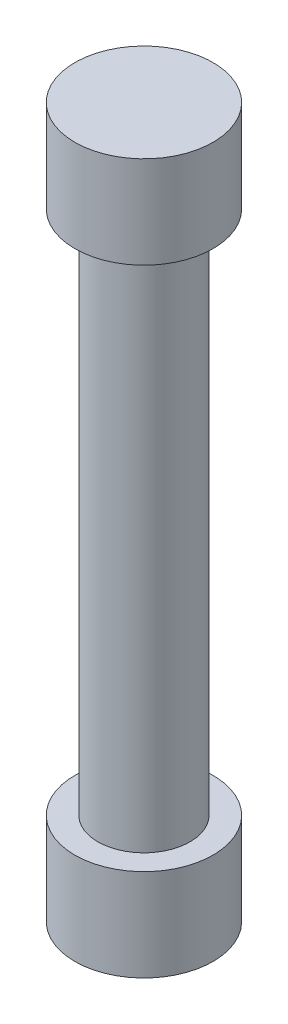
ISO-10303-21;
HEADER;
FILE_DESCRIPTION(('STEP AP214'),'2;1');
FILE_NAME('part.step','',(''),(''),'','','');
FILE_SCHEMA(('AUTOMOTIVE_DESIGN { 1 0 10303 214 1 1 1 1 }'));
ENDSEC;
DATA;
#1=APPLICATION_CONTEXT('core data for automotive mechanical design processes');
#2=APPLICATION_PROTOCOL_DEFINITION('international standard','automotive_design',2000,#1);
#3=PRODUCT_CONTEXT('',#1,'mechanical');
#4=PRODUCT('Part','Part','',(#3));
#5=PRODUCT_RELATED_PRODUCT_CATEGORY('part','',(#4));
#6=PRODUCT_DEFINITION_FORMATION('','',#4);
#7=PRODUCT_DEFINITION_CONTEXT('part definition',#1,'design');
#8=PRODUCT_DEFINITION('design','',#6,#7);
#9=PRODUCT_DEFINITION_SHAPE('','',#8);
#10=(LENGTH_UNIT() NAMED_UNIT(*) SI_UNIT(.MILLI.,.METRE.));
#11=(NAMED_UNIT(*) PLANE_ANGLE_UNIT() SI_UNIT($,.RADIAN.));
#12=(NAMED_UNIT(*) SI_UNIT($,.STERADIAN.) SOLID_ANGLE_UNIT());
#13=UNCERTAINTY_MEASURE_WITH_UNIT(LENGTH_MEASURE(1.E-05),#10,'distance_accuracy_value','');
#14=(GEOMETRIC_REPRESENTATION_CONTEXT(3) GLOBAL_UNCERTAINTY_ASSIGNED_CONTEXT((#13)) GLOBAL_UNIT_ASSIGNED_CONTEXT((#10,
#11,#12)) REPRESENTATION_CONTEXT('',''));
#15=CARTESIAN_POINT('',(0.,0.,0.));
#16=DIRECTION('',(0.,0.,1.));
#17=DIRECTION('',(1.,0.,0.));
#18=AXIS2_PLACEMENT_3D('',#15,#16,#17);
#19=CARTESIAN_POINT('',(0.,17.1,0.));
#20=DIRECTION('',(0.,-1.,0.));
#21=DIRECTION('',(0.,0.,-1.));
#22=AXIS2_PLACEMENT_3D('',#19,#20,#21);
#23=CYLINDRICAL_SURFACE('',#22,1.5);
#24=CARTESIAN_POINT('',(0.,17.1,0.));
#25=DIRECTION('',(0.,1.,0.));
#26=DIRECTION('',(0.,0.,1.));
#27=AXIS2_PLACEMENT_3D('',#24,#25,#26);
#28=CIRCLE('',#27,1.5);
#29=CARTESIAN_POINT('',(0.,17.1,1.5));
#30=VERTEX_POINT('',#29);
#31=EDGE_CURVE('E10',#30,#30,#28,.T.);
#32=ORIENTED_EDGE('',*,*,#31,.F.);
#33=EDGE_LOOP('',(#32));
#34=FACE_BOUND('',#33,.T.);
#35=CARTESIAN_POINT('',(0.,0.,0.));
#36=DIRECTION('',(0.,1.,0.));
#37=DIRECTION('',(0.,0.,1.));
#38=AXIS2_PLACEMENT_3D('',#35,#36,#37);
#39=CIRCLE('',#38,1.5);
#40=CARTESIAN_POINT('',(0.,0.,1.5));
#41=VERTEX_POINT('',#40);
#42=EDGE_CURVE('E37',#41,#41,#39,.T.);
#43=ORIENTED_EDGE('',*,*,#42,.T.);
#44=EDGE_LOOP('',(#43));
#45=FACE_BOUND('',#44,.T.);
#46=ADVANCED_FACE('F34',(#34,#45),#23,.T.);
#47=CARTESIAN_POINT('',(0.,20.1,0.));
#48=DIRECTION('',(0.,-1.,0.));
#49=DIRECTION('',(0.,0.,-1.));
#50=AXIS2_PLACEMENT_3D('',#47,#48,#49);
#51=CYLINDRICAL_SURFACE('',#50,2.25);
#52=CARTESIAN_POINT('',(0.,20.1,0.));
#53=DIRECTION('',(0.,1.,0.));
#54=DIRECTION('',(0.,0.,1.));
#55=AXIS2_PLACEMENT_3D('',#52,#53,#54);
#56=CIRCLE('',#55,2.25);
#57=CARTESIAN_POINT('',(0.,20.1,2.25));
#58=VERTEX_POINT('',#57);
#59=EDGE_CURVE('E41',#58,#58,#56,.T.);
#60=ORIENTED_EDGE('',*,*,#59,.F.);
#61=EDGE_LOOP('',(#60));
#62=FACE_BOUND('',#61,.T.);
#63=CARTESIAN_POINT('',(0.,17.1,0.));
#64=DIRECTION('',(0.,1.,0.));
#65=DIRECTION('',(0.,0.,1.));
#66=AXIS2_PLACEMENT_3D('',#63,#64,#65);
#67=CIRCLE('',#66,2.25);
#68=CARTESIAN_POINT('',(0.,17.1,2.25));
#69=VERTEX_POINT('',#68);
#70=EDGE_CURVE('E45',#69,#69,#67,.T.);
#71=ORIENTED_EDGE('',*,*,#70,.T.);
#72=EDGE_LOOP('',(#71));
#73=FACE_BOUND('',#72,.T.);
#74=ADVANCED_FACE('F82',(#62,#73),#51,.T.);
#75=CARTESIAN_POINT('',(0.,20.1,0.));
#76=DIRECTION('',(0.,1.,0.));
#77=DIRECTION('',(0.,0.,1.));
#78=AXIS2_PLACEMENT_3D('',#75,#76,#77);
#79=PLANE('',#78);
#80=ORIENTED_EDGE('',*,*,#59,.T.);
#81=EDGE_LOOP('',(#80));
#82=FACE_BOUND('',#81,.T.);
#83=ADVANCED_FACE('F78',(#82),#79,.T.);
#84=CARTESIAN_POINT('',(0.,17.1,0.));
#85=DIRECTION('',(0.,1.,0.));
#86=DIRECTION('',(0.,0.,1.));
#87=AXIS2_PLACEMENT_3D('',#84,#85,#86);
#88=PLANE('',#87);
#89=ORIENTED_EDGE('',*,*,#31,.T.);
#90=EDGE_LOOP('',(#89));
#91=FACE_BOUND('',#90,.T.);
#92=ORIENTED_EDGE('',*,*,#70,.F.);
#93=EDGE_LOOP('',(#92));
#94=FACE_BOUND('',#93,.T.);
#95=ADVANCED_FACE('F70',(#91,#94),#88,.F.);
#96=CARTESIAN_POINT('',(0.,-3.,0.));
#97=DIRECTION('',(0.,1.,0.));
#98=DIRECTION('',(0.,0.,1.));
#99=AXIS2_PLACEMENT_3D('',#96,#97,#98);
#100=CYLINDRICAL_SURFACE('',#99,2.25);
#101=CARTESIAN_POINT('',(0.,-3.,0.));
#102=DIRECTION('',(0.,1.,0.));
#103=DIRECTION('',(0.,0.,1.));
#104=AXIS2_PLACEMENT_3D('',#101,#102,#103);
#105=CIRCLE('',#104,2.25);
#106=CARTESIAN_POINT('',(0.,-3.,2.25));
#107=VERTEX_POINT('',#106);
#108=EDGE_CURVE('E53',#107,#107,#105,.T.);
#109=ORIENTED_EDGE('',*,*,#108,.T.);
#110=EDGE_LOOP('',(#109));
#111=FACE_BOUND('',#110,.T.);
#112=CARTESIAN_POINT('',(0.,0.,0.));
#113=DIRECTION('',(0.,1.,0.));
#114=DIRECTION('',(0.,0.,1.));
#115=AXIS2_PLACEMENT_3D('',#112,#113,#114);
#116=CIRCLE('',#115,2.25);
#117=CARTESIAN_POINT('',(0.,0.,2.25));
#118=VERTEX_POINT('',#117);
#119=EDGE_CURVE('E50',#118,#118,#116,.T.);
#120=ORIENTED_EDGE('',*,*,#119,.F.);
#121=EDGE_LOOP('',(#120));
#122=FACE_BOUND('',#121,.T.);
#123=ADVANCED_FACE('F68',(#111,#122),#100,.T.);
#124=CARTESIAN_POINT('',(0.,-3.,0.));
#125=DIRECTION('',(0.,1.,0.));
#126=DIRECTION('',(0.,0.,1.));
#127=AXIS2_PLACEMENT_3D('',#124,#125,#126);
#128=PLANE('',#127);
#129=ORIENTED_EDGE('',*,*,#108,.F.);
#130=EDGE_LOOP('',(#129));
#131=FACE_BOUND('',#130,.T.);
#132=ADVANCED_FACE('F64',(#131),#128,.F.);
#133=CARTESIAN_POINT('',(0.,0.,0.));
#134=DIRECTION('',(0.,1.,0.));
#135=DIRECTION('',(0.,0.,1.));
#136=AXIS2_PLACEMENT_3D('',#133,#134,#135);
#137=PLANE('',#136);
#138=ORIENTED_EDGE('',*,*,#42,.F.);
#139=EDGE_LOOP('',(#138));
#140=FACE_BOUND('',#139,.T.);
#141=ORIENTED_EDGE('',*,*,#119,.T.);
#142=EDGE_LOOP('',(#141));
#143=FACE_BOUND('',#142,.T.);
#144=ADVANCED_FACE('F61',(#140,#143),#137,.T.);
#145=CLOSED_SHELL('',(#46,#74,#83,#95,#123,#132,#144));
#146=MANIFOLD_SOLID_BREP('B2',#145);
#147=ADVANCED_BREP_SHAPE_REPRESENTATION('',(#18,#146),#14);
#148=SHAPE_DEFINITION_REPRESENTATION(#9,#147);
ENDSEC;
END-ISO-10303-21;
